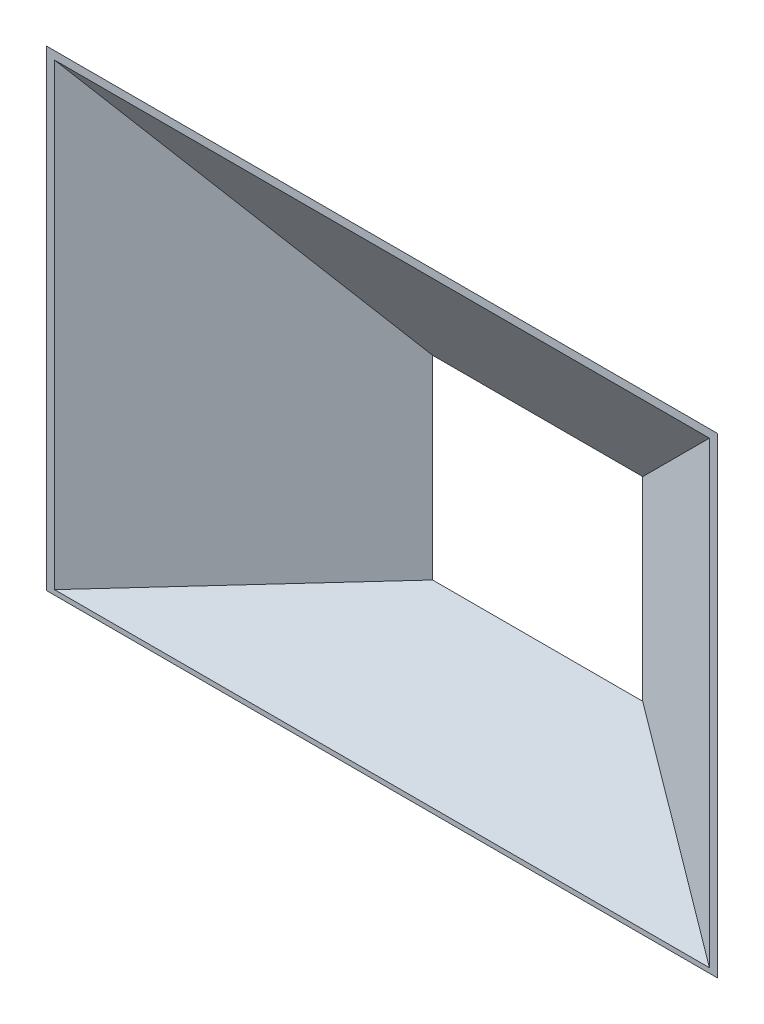
ISO-10303-21;
HEADER;
FILE_DESCRIPTION(('STEP AP214'),'2;1');
FILE_NAME('part.step','',(''),(''),'','','');
FILE_SCHEMA(('AUTOMOTIVE_DESIGN { 1 0 10303 214 1 1 1 1 }'));
ENDSEC;
DATA;
#1=APPLICATION_CONTEXT('core data for automotive mechanical design processes');
#2=APPLICATION_PROTOCOL_DEFINITION('international standard','automotive_design',2000,#1);
#3=PRODUCT_CONTEXT('',#1,'mechanical');
#4=PRODUCT('Part','Part','',(#3));
#5=PRODUCT_RELATED_PRODUCT_CATEGORY('part','',(#4));
#6=PRODUCT_DEFINITION_FORMATION('','',#4);
#7=PRODUCT_DEFINITION_CONTEXT('part definition',#1,'design');
#8=PRODUCT_DEFINITION('design','',#6,#7);
#9=PRODUCT_DEFINITION_SHAPE('','',#8);
#10=(LENGTH_UNIT() NAMED_UNIT(*) SI_UNIT(.MILLI.,.METRE.));
#11=(NAMED_UNIT(*) PLANE_ANGLE_UNIT() SI_UNIT($,.RADIAN.));
#12=(NAMED_UNIT(*) SI_UNIT($,.STERADIAN.) SOLID_ANGLE_UNIT());
#13=UNCERTAINTY_MEASURE_WITH_UNIT(LENGTH_MEASURE(1.E-05),#10,'distance_accuracy_value','');
#14=(GEOMETRIC_REPRESENTATION_CONTEXT(3) GLOBAL_UNCERTAINTY_ASSIGNED_CONTEXT((#13)) GLOBAL_UNIT_ASSIGNED_CONTEXT((#10,
#11,#12)) REPRESENTATION_CONTEXT('',''));
#15=CARTESIAN_POINT('',(0.,0.,0.));
#16=DIRECTION('',(0.,0.,1.));
#17=DIRECTION('',(1.,0.,0.));
#18=AXIS2_PLACEMENT_3D('',#15,#16,#17);
#19=CARTESIAN_POINT('',(0.,0.,0.));
#20=DIRECTION('',(0.,0.,1.));
#21=DIRECTION('',(1.,0.,0.));
#22=AXIS2_PLACEMENT_3D('',#19,#20,#21);
#23=PLANE('',#22);
#24=DIRECTION('',(0.,1.,0.));
#25=VECTOR('',#24,1.);
#26=CARTESIAN_POINT('',(72.7303403868632,0.,0.));
#27=LINE('',#26,#25);
#28=CARTESIAN_POINT('',(72.7303403868633,-65.6058285412302,0.));
#29=VERTEX_POINT('',#28);
#30=CARTESIAN_POINT('',(72.7303403868632,67.7303403868633,0.));
#31=VERTEX_POINT('',#30);
#32=EDGE_CURVE('E227',#29,#31,#27,.T.);
#33=ORIENTED_EDGE('',*,*,#32,.F.);
#34=DIRECTION('',(1.,0.,0.));
#35=VECTOR('',#34,1.);
#36=CARTESIAN_POINT('',(0.,-65.6058285412302,0.));
#37=LINE('',#36,#35);
#38=CARTESIAN_POINT('',(-72.7303403868631,-65.6058285412302,0.));
#39=VERTEX_POINT('',#38);
#40=EDGE_CURVE('E229',#39,#29,#37,.T.);
#41=ORIENTED_EDGE('',*,*,#40,.F.);
#42=DIRECTION('',(0.,-1.,0.));
#43=VECTOR('',#42,1.);
#44=CARTESIAN_POINT('',(-72.7303403868631,0.,0.));
#45=LINE('',#44,#43);
#46=CARTESIAN_POINT('',(-72.7303403868631,67.7303403868632,0.));
#47=VERTEX_POINT('',#46);
#48=EDGE_CURVE('E377',#47,#39,#45,.T.);
#49=ORIENTED_EDGE('',*,*,#48,.F.);
#50=DIRECTION('',(-1.,0.,0.));
#51=VECTOR('',#50,1.);
#52=CARTESIAN_POINT('',(0.,67.7303403868633,0.));
#53=LINE('',#52,#51);
#54=EDGE_CURVE('E381',#31,#47,#53,.T.);
#55=ORIENTED_EDGE('',*,*,#54,.F.);
#56=EDGE_LOOP('',(#33,#41,#49,#55));
#57=FACE_BOUND('',#56,.T.);
#58=DIRECTION('',(0.,1.,0.));
#59=VECTOR('',#58,1.);
#60=CARTESIAN_POINT('',(67.5,62.5,0.));
#61=LINE('',#60,#59);
#62=CARTESIAN_POINT('',(67.5,-62.5,0.));
#63=VERTEX_POINT('',#62);
#64=CARTESIAN_POINT('',(67.5,62.5,0.));
#65=VERTEX_POINT('',#64);
#66=EDGE_CURVE('E129',#63,#65,#61,.T.);
#67=ORIENTED_EDGE('',*,*,#66,.T.);
#68=DIRECTION('',(-1.,0.,0.));
#69=VECTOR('',#68,1.);
#70=CARTESIAN_POINT('',(-67.5,62.5,0.));
#71=LINE('',#70,#69);
#72=CARTESIAN_POINT('',(-67.5,62.5,0.));
#73=VERTEX_POINT('',#72);
#74=EDGE_CURVE('E113',#65,#73,#71,.T.);
#75=ORIENTED_EDGE('',*,*,#74,.T.);
#76=DIRECTION('',(0.,-1.,0.));
#77=VECTOR('',#76,1.);
#78=CARTESIAN_POINT('',(-67.5,62.5,0.));
#79=LINE('',#78,#77);
#80=CARTESIAN_POINT('',(-67.5,-62.5,0.));
#81=VERTEX_POINT('',#80);
#82=EDGE_CURVE('E72',#73,#81,#79,.T.);
#83=ORIENTED_EDGE('',*,*,#82,.T.);
#84=DIRECTION('',(1.,0.,0.));
#85=VECTOR('',#84,1.);
#86=CARTESIAN_POINT('',(-67.5,-62.5,0.));
#87=LINE('',#86,#85);
#88=EDGE_CURVE('E139',#81,#63,#87,.T.);
#89=ORIENTED_EDGE('',*,*,#88,.T.);
#90=EDGE_LOOP('',(#67,#75,#83,#89));
#91=FACE_BOUND('',#90,.T.);
#92=ADVANCED_FACE('F46',(#57,#91),#23,.F.);
#93=CARTESIAN_POINT('',(0.,0.,100.));
#94=DIRECTION('',(0.,0.,1.));
#95=DIRECTION('',(1.,0.,0.));
#96=AXIS2_PLACEMENT_3D('',#93,#94,#95);
#97=PLANE('',#96);
#98=DIRECTION('',(1.,0.,0.));
#99=VECTOR('',#98,1.);
#100=CARTESIAN_POINT('',(-210.314800674209,-89.294919243112,100.));
#101=LINE('',#100,#99);
#102=CARTESIAN_POINT('',(-210.314800674209,-89.294919243112,100.));
#103=VERTEX_POINT('',#102);
#104=CARTESIAN_POINT('',(210.314800674209,-89.2949192431118,100.));
#105=VERTEX_POINT('',#104);
#106=EDGE_CURVE('E134',#103,#105,#101,.T.);
#107=ORIENTED_EDGE('',*,*,#106,.F.);
#108=DIRECTION('',(0.,-1.,0.));
#109=VECTOR('',#108,1.);
#110=CARTESIAN_POINT('',(-210.314800674209,205.314800674213,100.));
#111=LINE('',#110,#109);
#112=CARTESIAN_POINT('',(-210.314800674209,205.314800674213,100.));
#113=VERTEX_POINT('',#112);
#114=EDGE_CURVE('E195',#113,#103,#111,.T.);
#115=ORIENTED_EDGE('',*,*,#114,.F.);
#116=DIRECTION('',(-1.,0.,0.));
#117=VECTOR('',#116,1.);
#118=CARTESIAN_POINT('',(210.314800674209,205.314800674213,100.));
#119=LINE('',#118,#117);
#120=CARTESIAN_POINT('',(210.314800674209,205.314800674213,100.));
#121=VERTEX_POINT('',#120);
#122=EDGE_CURVE('E64',#121,#113,#119,.T.);
#123=ORIENTED_EDGE('',*,*,#122,.F.);
#124=DIRECTION('',(0.,1.,0.));
#125=VECTOR('',#124,1.);
#126=CARTESIAN_POINT('',(210.314800674209,-89.2949192431118,100.));
#127=LINE('',#126,#125);
#128=EDGE_CURVE('E50',#105,#121,#127,.T.);
#129=ORIENTED_EDGE('',*,*,#128,.F.);
#130=EDGE_LOOP('',(#107,#115,#123,#129));
#131=FACE_BOUND('',#130,.T.);
#132=DIRECTION('',(1.,0.,0.));
#133=VECTOR('',#132,1.);
#134=CARTESIAN_POINT('',(0.,-92.4007477843421,100.));
#135=LINE('',#134,#133);
#136=CARTESIAN_POINT('',(-215.545141061072,-92.4007477843422,100.));
#137=VERTEX_POINT('',#136);
#138=CARTESIAN_POINT('',(215.545141061072,-92.400747784342,100.));
#139=VERTEX_POINT('',#138);
#140=EDGE_CURVE('E392',#137,#139,#135,.T.);
#141=ORIENTED_EDGE('',*,*,#140,.T.);
#142=DIRECTION('',(0.,1.,0.));
#143=VECTOR('',#142,1.);
#144=CARTESIAN_POINT('',(215.545141061072,1.0153397964909E-13,100.));
#145=LINE('',#144,#143);
#146=CARTESIAN_POINT('',(215.545141061072,210.545141061076,100.));
#147=VERTEX_POINT('',#146);
#148=EDGE_CURVE('E397',#139,#147,#145,.T.);
#149=ORIENTED_EDGE('',*,*,#148,.T.);
#150=DIRECTION('',(-1.,0.,0.));
#151=VECTOR('',#150,1.);
#152=CARTESIAN_POINT('',(0.,210.545141061076,100.));
#153=LINE('',#152,#151);
#154=CARTESIAN_POINT('',(-215.545141061072,210.545141061076,100.));
#155=VERTEX_POINT('',#154);
#156=EDGE_CURVE('E56',#147,#155,#153,.T.);
#157=ORIENTED_EDGE('',*,*,#156,.T.);
#158=DIRECTION('',(0.,-1.,0.));
#159=VECTOR('',#158,1.);
#160=CARTESIAN_POINT('',(-215.545141061072,0.,100.));
#161=LINE('',#160,#159);
#162=EDGE_CURVE('E12',#155,#137,#161,.T.);
#163=ORIENTED_EDGE('',*,*,#162,.T.);
#164=EDGE_LOOP('',(#141,#149,#157,#163));
#165=FACE_BOUND('',#164,.T.);
#166=ADVANCED_FACE('F161',(#131,#165),#97,.T.);
#167=CARTESIAN_POINT('',(-23.9275494718124,0.,-34.1720820843915));
#168=DIRECTION('',(0.573576436351054,0.,0.819152044288986));
#169=DIRECTION('',(0.819152044288987,0.,-0.573576436351054));
#170=AXIS2_PLACEMENT_3D('',#167,#168,#169);
#171=PLANE('',#170);
#172=DIRECTION('',(-0.809645768037895,-0.1519057749455,0.566920070059735));
#173=VECTOR('',#172,1.);
#174=CARTESIAN_POINT('',(-16.9848394780851,-55.1468551857657,-39.0334199576034));
#175=LINE('',#174,#173);
#176=EDGE_CURVE('E374',#39,#137,#175,.T.);
#177=ORIENTED_EDGE('',*,*,#176,.T.);
#178=ORIENTED_EDGE('',*,*,#162,.F.);
#179=DIRECTION('',(-0.633687274224632,0.633687274224651,0.443712606279659));
#180=VECTOR('',#179,1.);
#181=CARTESIAN_POINT('',(-16.3270110053726,11.327011005371,-39.4940364130457));
#182=LINE('',#181,#180);
#183=EDGE_CURVE('E380',#47,#155,#182,.T.);
#184=ORIENTED_EDGE('',*,*,#183,.F.);
#185=ORIENTED_EDGE('',*,*,#48,.T.);
#186=EDGE_LOOP('',(#177,#178,#184,#185));
#187=FACE_BOUND('',#186,.T.);
#188=ADVANCED_FACE('F345',(#187),#171,.F.);
#189=CARTESIAN_POINT('',(0.,22.2825998301256,-31.8228505324265));
#190=DIRECTION('',(0.,0.573576436351042,-0.819152044288995));
#191=DIRECTION('',(0.,0.819152044288995,0.573576436351042));
#192=AXIS2_PLACEMENT_3D('',#189,#190,#191);
#193=PLANE('',#192);
#194=ORIENTED_EDGE('',*,*,#183,.T.);
#195=ORIENTED_EDGE('',*,*,#156,.F.);
#196=DIRECTION('',(0.633687274224632,0.633687274224651,0.443712606279659));
#197=VECTOR('',#196,1.);
#198=CARTESIAN_POINT('',(16.3270110053726,11.3270110053709,-39.4940364130457));
#199=LINE('',#198,#197);
#200=EDGE_CURVE('E389',#31,#147,#199,.T.);
#201=ORIENTED_EDGE('',*,*,#200,.F.);
#202=ORIENTED_EDGE('',*,*,#54,.T.);
#203=EDGE_LOOP('',(#194,#195,#201,#202));
#204=FACE_BOUND('',#203,.T.);
#205=ADVANCED_FACE('F336',(#204),#193,.T.);
#206=CARTESIAN_POINT('',(0.,-61.211071347131,-16.4014571353074));
#207=DIRECTION('',(0.,-0.965925826289069,-0.258819045102517));
#208=DIRECTION('',(0.,0.258819045102518,-0.965925826289069));
#209=AXIS2_PLACEMENT_3D('',#206,#207,#208);
#210=PLANE('',#209);
#211=DIRECTION('',(0.809645768037895,-0.151905774945499,0.566920070059735));
#212=VECTOR('',#211,1.);
#213=CARTESIAN_POINT('',(16.9848394780852,-55.1468551857656,-39.0334199576034));
#214=LINE('',#213,#212);
#215=EDGE_CURVE('E383',#29,#139,#214,.T.);
#216=ORIENTED_EDGE('',*,*,#215,.T.);
#217=ORIENTED_EDGE('',*,*,#140,.F.);
#218=ORIENTED_EDGE('',*,*,#176,.F.);
#219=ORIENTED_EDGE('',*,*,#40,.T.);
#220=EDGE_LOOP('',(#216,#217,#218,#219));
#221=FACE_BOUND('',#220,.T.);
#222=ADVANCED_FACE('F327',(#221),#210,.T.);
#223=CARTESIAN_POINT('',(23.9275494718124,0.,-34.1720820843916));
#224=DIRECTION('',(-0.573576436351053,0.,0.819152044288987));
#225=DIRECTION('',(0.819152044288987,0.,0.573576436351053));
#226=AXIS2_PLACEMENT_3D('',#223,#224,#225);
#227=PLANE('',#226);
#228=ORIENTED_EDGE('',*,*,#200,.T.);
#229=ORIENTED_EDGE('',*,*,#148,.F.);
#230=ORIENTED_EDGE('',*,*,#215,.F.);
#231=ORIENTED_EDGE('',*,*,#32,.T.);
#232=EDGE_LOOP('',(#228,#229,#230,#231));
#233=FACE_BOUND('',#232,.T.);
#234=ADVANCED_FACE('F48',(#233),#227,.F.);
#235=CARTESIAN_POINT('',(-22.2068201627592,0.,-31.7146259515246));
#236=DIRECTION('',(0.573576436351054,0.,0.819152044288986));
#237=DIRECTION('',(0.819152044288987,0.,-0.573576436351054));
#238=AXIS2_PLACEMENT_3D('',#235,#236,#237);
#239=PLANE('',#238);
#240=DIRECTION('',(-0.809645768037895,-0.1519057749455,0.566920070059735));
#241=VECTOR('',#240,1.);
#242=CARTESIAN_POINT('',(-67.5,-62.5,0.));
#243=LINE('',#242,#241);
#244=EDGE_CURVE('E123',#81,#103,#243,.T.);
#245=ORIENTED_EDGE('',*,*,#244,.F.);
#246=ORIENTED_EDGE('',*,*,#82,.F.);
#247=DIRECTION('',(-0.633687274224632,0.633687274224651,0.443712606279659));
#248=VECTOR('',#247,1.);
#249=CARTESIAN_POINT('',(-67.5,62.5,0.));
#250=LINE('',#249,#248);
#251=EDGE_CURVE('E119',#73,#113,#250,.T.);
#252=ORIENTED_EDGE('',*,*,#251,.T.);
#253=ORIENTED_EDGE('',*,*,#114,.T.);
#254=EDGE_LOOP('',(#245,#246,#252,#253));
#255=FACE_BOUND('',#254,.T.);
#256=ADVANCED_FACE('F258',(#255),#239,.T.);
#257=CARTESIAN_POINT('',(0.,20.5618705210725,-29.3653943995595));
#258=DIRECTION('',(0.,0.573576436351042,-0.819152044288995));
#259=DIRECTION('',(0.,0.819152044288995,0.573576436351042));
#260=AXIS2_PLACEMENT_3D('',#257,#258,#259);
#261=PLANE('',#260);
#262=ORIENTED_EDGE('',*,*,#251,.F.);
#263=ORIENTED_EDGE('',*,*,#74,.F.);
#264=DIRECTION('',(0.633687274224631,0.633687274224652,0.443712606279659));
#265=VECTOR('',#264,1.);
#266=CARTESIAN_POINT('',(67.5,62.5,0.));
#267=LINE('',#266,#265);
#268=EDGE_CURVE('E117',#65,#121,#267,.T.);
#269=ORIENTED_EDGE('',*,*,#268,.T.);
#270=ORIENTED_EDGE('',*,*,#122,.T.);
#271=EDGE_LOOP('',(#262,#263,#269,#270));
#272=FACE_BOUND('',#271,.T.);
#273=ADVANCED_FACE('F116',(#272),#261,.F.);
#274=CARTESIAN_POINT('',(0.,-58.3132938682638,-15.6249999999998));
#275=DIRECTION('',(0.,-0.965925826289069,-0.258819045102517));
#276=DIRECTION('',(0.,0.258819045102518,-0.965925826289069));
#277=AXIS2_PLACEMENT_3D('',#274,#275,#276);
#278=PLANE('',#277);
#279=DIRECTION('',(0.809645768037895,-0.151905774945499,0.566920070059735));
#280=VECTOR('',#279,1.);
#281=CARTESIAN_POINT('',(67.5,-62.5,0.));
#282=LINE('',#281,#280);
#283=EDGE_CURVE('E135',#63,#105,#282,.T.);
#284=ORIENTED_EDGE('',*,*,#283,.F.);
#285=ORIENTED_EDGE('',*,*,#88,.F.);
#286=ORIENTED_EDGE('',*,*,#244,.T.);
#287=ORIENTED_EDGE('',*,*,#106,.T.);
#288=EDGE_LOOP('',(#284,#285,#286,#287));
#289=FACE_BOUND('',#288,.T.);
#290=ADVANCED_FACE('F234',(#289),#278,.F.);
#291=CARTESIAN_POINT('',(22.2068201627593,0.,-31.7146259515246));
#292=DIRECTION('',(-0.573576436351053,0.,0.819152044288987));
#293=DIRECTION('',(0.819152044288987,0.,0.573576436351053));
#294=AXIS2_PLACEMENT_3D('',#291,#292,#293);
#295=PLANE('',#294);
#296=ORIENTED_EDGE('',*,*,#268,.F.);
#297=ORIENTED_EDGE('',*,*,#66,.F.);
#298=ORIENTED_EDGE('',*,*,#283,.T.);
#299=ORIENTED_EDGE('',*,*,#128,.T.);
#300=EDGE_LOOP('',(#296,#297,#298,#299));
#301=FACE_BOUND('',#300,.T.);
#302=ADVANCED_FACE('F128',(#301),#295,.T.);
#303=CLOSED_SHELL('',(#92,#166,#188,#205,#222,#234,#256,#273,#290,#302));
#304=MANIFOLD_SOLID_BREP('B2',#303);
#305=ADVANCED_BREP_SHAPE_REPRESENTATION('',(#18,#304),#14);
#306=SHAPE_DEFINITION_REPRESENTATION(#9,#305);
ENDSEC;
END-ISO-10303-21;
